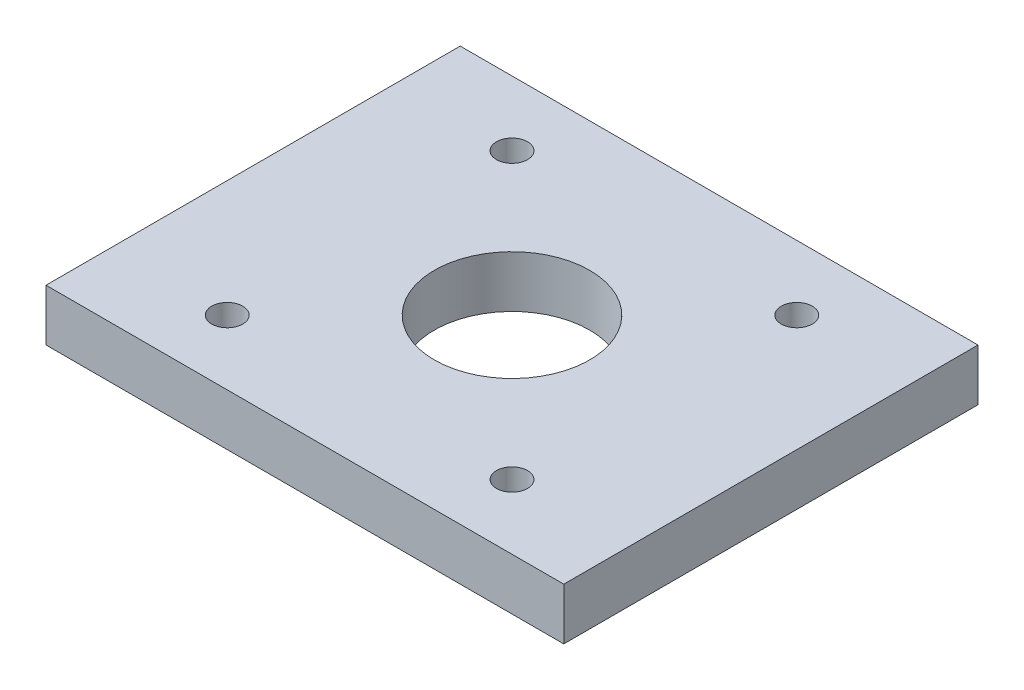
ISO-10303-21;
HEADER;
FILE_DESCRIPTION(('STEP AP214'),'2;1');
FILE_NAME('part.step','',(''),(''),'','','');
FILE_SCHEMA(('AUTOMOTIVE_DESIGN { 1 0 10303 214 1 1 1 1 }'));
ENDSEC;
DATA;
#1=APPLICATION_CONTEXT('core data for automotive mechanical design processes');
#2=APPLICATION_PROTOCOL_DEFINITION('international standard','automotive_design',2000,#1);
#3=PRODUCT_CONTEXT('',#1,'mechanical');
#4=PRODUCT('Part','Part','',(#3));
#5=PRODUCT_RELATED_PRODUCT_CATEGORY('part','',(#4));
#6=PRODUCT_DEFINITION_FORMATION('','',#4);
#7=PRODUCT_DEFINITION_CONTEXT('part definition',#1,'design');
#8=PRODUCT_DEFINITION('design','',#6,#7);
#9=PRODUCT_DEFINITION_SHAPE('','',#8);
#10=(LENGTH_UNIT() NAMED_UNIT(*) SI_UNIT(.MILLI.,.METRE.));
#11=(NAMED_UNIT(*) PLANE_ANGLE_UNIT() SI_UNIT($,.RADIAN.));
#12=(NAMED_UNIT(*) SI_UNIT($,.STERADIAN.) SOLID_ANGLE_UNIT());
#13=UNCERTAINTY_MEASURE_WITH_UNIT(LENGTH_MEASURE(1.E-05),#10,'distance_accuracy_value','');
#14=(GEOMETRIC_REPRESENTATION_CONTEXT(3) GLOBAL_UNCERTAINTY_ASSIGNED_CONTEXT((#13)) GLOBAL_UNIT_ASSIGNED_CONTEXT((#10,
#11,#12)) REPRESENTATION_CONTEXT('',''));
#15=CARTESIAN_POINT('',(0.,0.,0.));
#16=DIRECTION('',(0.,0.,1.));
#17=DIRECTION('',(1.,0.,0.));
#18=AXIS2_PLACEMENT_3D('',#15,#16,#17);
#19=CARTESIAN_POINT('',(0.,0.,0.));
#20=DIRECTION('',(0.,-1.,0.));
#21=DIRECTION('',(0.,0.,-1.));
#22=AXIS2_PLACEMENT_3D('',#19,#20,#21);
#23=PLANE('',#22);
#24=CARTESIAN_POINT('',(-55.,0.,-55.));
#25=DIRECTION('',(0.,-1.,0.));
#26=DIRECTION('',(0.,0.,-1.));
#27=AXIS2_PLACEMENT_3D('',#24,#25,#26);
#28=CIRCLE('',#27,11.);
#29=CARTESIAN_POINT('',(-55.,0.,-66.));
#30=VERTEX_POINT('',#29);
#31=EDGE_CURVE('E47',#30,#30,#28,.F.);
#32=ORIENTED_EDGE('',*,*,#31,.T.);
#33=EDGE_LOOP('',(#32));
#34=FACE_BOUND('',#33,.T.);
#35=CARTESIAN_POINT('',(-55.,0.,55.));
#36=DIRECTION('',(0.,-1.,0.));
#37=DIRECTION('',(0.,0.,-1.));
#38=AXIS2_PLACEMENT_3D('',#35,#36,#37);
#39=CIRCLE('',#38,11.);
#40=CARTESIAN_POINT('',(-55.,0.,44.));
#41=VERTEX_POINT('',#40);
#42=EDGE_CURVE('E117',#41,#41,#39,.F.);
#43=ORIENTED_EDGE('',*,*,#42,.T.);
#44=EDGE_LOOP('',(#43));
#45=FACE_BOUND('',#44,.T.);
#46=CARTESIAN_POINT('',(0.,0.,0.));
#47=DIRECTION('',(0.,-1.,0.));
#48=DIRECTION('',(0.,0.,-1.));
#49=AXIS2_PLACEMENT_3D('',#46,#47,#48);
#50=CIRCLE('',#49,30.);
#51=CARTESIAN_POINT('',(0.,0.,-30.));
#52=VERTEX_POINT('',#51);
#53=EDGE_CURVE('E112',#52,#52,#50,.T.);
#54=ORIENTED_EDGE('',*,*,#53,.F.);
#55=EDGE_LOOP('',(#54));
#56=FACE_BOUND('',#55,.T.);
#57=DIRECTION('',(0.,0.,1.));
#58=VECTOR('',#57,1.);
#59=CARTESIAN_POINT('',(100.,0.,-80.));
#60=LINE('',#59,#58);
#61=CARTESIAN_POINT('',(100.,0.,-80.));
#62=VERTEX_POINT('',#61);
#63=CARTESIAN_POINT('',(100.,0.,80.));
#64=VERTEX_POINT('',#63);
#65=EDGE_CURVE('E108',#62,#64,#60,.T.);
#66=ORIENTED_EDGE('',*,*,#65,.T.);
#67=DIRECTION('',(-1.,0.,0.));
#68=VECTOR('',#67,1.);
#69=CARTESIAN_POINT('',(100.,0.,80.));
#70=LINE('',#69,#68);
#71=CARTESIAN_POINT('',(-100.,0.,80.));
#72=VERTEX_POINT('',#71);
#73=EDGE_CURVE('E111',#64,#72,#70,.T.);
#74=ORIENTED_EDGE('',*,*,#73,.T.);
#75=DIRECTION('',(0.,0.,1.));
#76=VECTOR('',#75,1.);
#77=CARTESIAN_POINT('',(-100.,0.,-80.));
#78=LINE('',#77,#76);
#79=CARTESIAN_POINT('',(-100.,0.,-80.));
#80=VERTEX_POINT('',#79);
#81=EDGE_CURVE('E97',#80,#72,#78,.T.);
#82=ORIENTED_EDGE('',*,*,#81,.F.);
#83=DIRECTION('',(-1.,0.,0.));
#84=VECTOR('',#83,1.);
#85=CARTESIAN_POINT('',(100.,0.,-80.));
#86=LINE('',#85,#84);
#87=EDGE_CURVE('E72',#62,#80,#86,.T.);
#88=ORIENTED_EDGE('',*,*,#87,.F.);
#89=EDGE_LOOP('',(#66,#74,#82,#88));
#90=FACE_BOUND('',#89,.T.);
#91=CARTESIAN_POINT('',(55.,0.,55.));
#92=DIRECTION('',(0.,-1.,0.));
#93=DIRECTION('',(0.,0.,-1.));
#94=AXIS2_PLACEMENT_3D('',#91,#92,#93);
#95=CIRCLE('',#94,11.);
#96=CARTESIAN_POINT('',(55.,0.,44.));
#97=VERTEX_POINT('',#96);
#98=EDGE_CURVE('E126',#97,#97,#95,.F.);
#99=ORIENTED_EDGE('',*,*,#98,.T.);
#100=EDGE_LOOP('',(#99));
#101=FACE_BOUND('',#100,.T.);
#102=CARTESIAN_POINT('',(55.,0.,-55.));
#103=DIRECTION('',(0.,-1.,0.));
#104=DIRECTION('',(0.,0.,-1.));
#105=AXIS2_PLACEMENT_3D('',#102,#103,#104);
#106=CIRCLE('',#105,11.);
#107=CARTESIAN_POINT('',(55.,0.,-66.));
#108=VERTEX_POINT('',#107);
#109=EDGE_CURVE('E11',#108,#108,#106,.F.);
#110=ORIENTED_EDGE('',*,*,#109,.T.);
#111=EDGE_LOOP('',(#110));
#112=FACE_BOUND('',#111,.T.);
#113=ADVANCED_FACE('F37',(#34,#45,#56,#90,#101,#112),#23,.T.);
#114=ORIENTED_EDGE('',*,*,#109,.F.);
#115=EDGE_LOOP('',(#114));
#116=FACE_BOUND('',#115,.T.);
#117=CARTESIAN_POINT('',(55.,0.,-55.));
#118=DIRECTION('',(0.,-1.,0.));
#119=DIRECTION('',(0.,0.,-1.));
#120=AXIS2_PLACEMENT_3D('',#117,#118,#119);
#121=CIRCLE('',#120,5.99999999999999);
#122=CARTESIAN_POINT('',(55.,0.,-61.));
#123=VERTEX_POINT('',#122);
#124=EDGE_CURVE('E154',#123,#123,#121,.T.);
#125=ORIENTED_EDGE('',*,*,#124,.F.);
#126=EDGE_LOOP('',(#125));
#127=FACE_BOUND('',#126,.T.);
#128=ADVANCED_FACE('F141',(#116,#127),#23,.T.);
#129=ORIENTED_EDGE('',*,*,#31,.F.);
#130=EDGE_LOOP('',(#129));
#131=FACE_BOUND('',#130,.T.);
#132=CARTESIAN_POINT('',(-55.,0.,-55.));
#133=DIRECTION('',(0.,-1.,0.));
#134=DIRECTION('',(0.,0.,-1.));
#135=AXIS2_PLACEMENT_3D('',#132,#133,#134);
#136=CIRCLE('',#135,5.99999999999999);
#137=CARTESIAN_POINT('',(-55.,0.,-61.));
#138=VERTEX_POINT('',#137);
#139=EDGE_CURVE('E145',#138,#138,#136,.T.);
#140=ORIENTED_EDGE('',*,*,#139,.F.);
#141=EDGE_LOOP('',(#140));
#142=FACE_BOUND('',#141,.T.);
#143=ADVANCED_FACE('F137',(#131,#142),#23,.T.);
#144=ORIENTED_EDGE('',*,*,#98,.F.);
#145=EDGE_LOOP('',(#144));
#146=FACE_BOUND('',#145,.T.);
#147=CARTESIAN_POINT('',(55.,0.,55.));
#148=DIRECTION('',(0.,-1.,0.));
#149=DIRECTION('',(0.,0.,-1.));
#150=AXIS2_PLACEMENT_3D('',#147,#148,#149);
#151=CIRCLE('',#150,5.99999999999999);
#152=CARTESIAN_POINT('',(55.,0.,49.));
#153=VERTEX_POINT('',#152);
#154=EDGE_CURVE('E163',#153,#153,#151,.T.);
#155=ORIENTED_EDGE('',*,*,#154,.F.);
#156=EDGE_LOOP('',(#155));
#157=FACE_BOUND('',#156,.T.);
#158=ADVANCED_FACE('F140',(#146,#157),#23,.T.);
#159=CARTESIAN_POINT('',(100.,20.,-80.));
#160=DIRECTION('',(1.,0.,0.));
#161=DIRECTION('',(0.,0.,-1.));
#162=AXIS2_PLACEMENT_3D('',#159,#160,#161);
#163=PLANE('',#162);
#164=ORIENTED_EDGE('',*,*,#65,.F.);
#165=DIRECTION('',(0.,-1.,0.));
#166=VECTOR('',#165,1.);
#167=CARTESIAN_POINT('',(100.,20.,-80.));
#168=LINE('',#167,#166);
#169=CARTESIAN_POINT('',(100.,20.,-80.));
#170=VERTEX_POINT('',#169);
#171=EDGE_CURVE('E55',#170,#62,#168,.T.);
#172=ORIENTED_EDGE('',*,*,#171,.F.);
#173=DIRECTION('',(0.,0.,1.));
#174=VECTOR('',#173,1.);
#175=CARTESIAN_POINT('',(100.,20.,-80.));
#176=LINE('',#175,#174);
#177=CARTESIAN_POINT('',(100.,20.,80.));
#178=VERTEX_POINT('',#177);
#179=EDGE_CURVE('E102',#170,#178,#176,.T.);
#180=ORIENTED_EDGE('',*,*,#179,.T.);
#181=DIRECTION('',(0.,-1.,0.));
#182=VECTOR('',#181,1.);
#183=CARTESIAN_POINT('',(100.,20.,80.));
#184=LINE('',#183,#182);
#185=EDGE_CURVE('E80',#178,#64,#184,.T.);
#186=ORIENTED_EDGE('',*,*,#185,.T.);
#187=EDGE_LOOP('',(#164,#172,#180,#186));
#188=FACE_BOUND('',#187,.T.);
#189=ADVANCED_FACE('F39',(#188),#163,.T.);
#190=CARTESIAN_POINT('',(100.,20.,-80.));
#191=DIRECTION('',(0.,0.,1.));
#192=DIRECTION('',(1.,0.,0.));
#193=AXIS2_PLACEMENT_3D('',#190,#191,#192);
#194=PLANE('',#193);
#195=ORIENTED_EDGE('',*,*,#87,.T.);
#196=DIRECTION('',(0.,-1.,0.));
#197=VECTOR('',#196,1.);
#198=CARTESIAN_POINT('',(-100.,20.,-80.));
#199=LINE('',#198,#197);
#200=CARTESIAN_POINT('',(-100.,20.,-80.));
#201=VERTEX_POINT('',#200);
#202=EDGE_CURVE('E99',#201,#80,#199,.T.);
#203=ORIENTED_EDGE('',*,*,#202,.F.);
#204=DIRECTION('',(-1.,0.,0.));
#205=VECTOR('',#204,1.);
#206=CARTESIAN_POINT('',(100.,20.,-80.));
#207=LINE('',#206,#205);
#208=EDGE_CURVE('E90',#170,#201,#207,.T.);
#209=ORIENTED_EDGE('',*,*,#208,.F.);
#210=ORIENTED_EDGE('',*,*,#171,.T.);
#211=EDGE_LOOP('',(#195,#203,#209,#210));
#212=FACE_BOUND('',#211,.T.);
#213=ADVANCED_FACE('F188',(#212),#194,.F.);
#214=CARTESIAN_POINT('',(-100.,20.,-80.));
#215=DIRECTION('',(1.,0.,0.));
#216=DIRECTION('',(0.,0.,-1.));
#217=AXIS2_PLACEMENT_3D('',#214,#215,#216);
#218=PLANE('',#217);
#219=ORIENTED_EDGE('',*,*,#81,.T.);
#220=DIRECTION('',(0.,-1.,0.));
#221=VECTOR('',#220,1.);
#222=CARTESIAN_POINT('',(-100.,20.,80.));
#223=LINE('',#222,#221);
#224=CARTESIAN_POINT('',(-100.,20.,80.));
#225=VERTEX_POINT('',#224);
#226=EDGE_CURVE('E94',#225,#72,#223,.T.);
#227=ORIENTED_EDGE('',*,*,#226,.F.);
#228=DIRECTION('',(0.,0.,1.));
#229=VECTOR('',#228,1.);
#230=CARTESIAN_POINT('',(-100.,20.,-80.));
#231=LINE('',#230,#229);
#232=EDGE_CURVE('E85',#201,#225,#231,.T.);
#233=ORIENTED_EDGE('',*,*,#232,.F.);
#234=ORIENTED_EDGE('',*,*,#202,.T.);
#235=EDGE_LOOP('',(#219,#227,#233,#234));
#236=FACE_BOUND('',#235,.T.);
#237=ADVANCED_FACE('F95',(#236),#218,.F.);
#238=CARTESIAN_POINT('',(100.,20.,80.));
#239=DIRECTION('',(0.,0.,1.));
#240=DIRECTION('',(1.,0.,0.));
#241=AXIS2_PLACEMENT_3D('',#238,#239,#240);
#242=PLANE('',#241);
#243=ORIENTED_EDGE('',*,*,#73,.F.);
#244=ORIENTED_EDGE('',*,*,#185,.F.);
#245=DIRECTION('',(-1.,0.,0.));
#246=VECTOR('',#245,1.);
#247=CARTESIAN_POINT('',(100.,20.,80.));
#248=LINE('',#247,#246);
#249=EDGE_CURVE('E89',#178,#225,#248,.T.);
#250=ORIENTED_EDGE('',*,*,#249,.T.);
#251=ORIENTED_EDGE('',*,*,#226,.T.);
#252=EDGE_LOOP('',(#243,#244,#250,#251));
#253=FACE_BOUND('',#252,.T.);
#254=ADVANCED_FACE('F101',(#253),#242,.T.);
#255=CARTESIAN_POINT('',(0.,20.,0.));
#256=DIRECTION('',(0.,-1.,0.));
#257=DIRECTION('',(0.,0.,-1.));
#258=AXIS2_PLACEMENT_3D('',#255,#256,#257);
#259=PLANE('',#258);
#260=CARTESIAN_POINT('',(55.,20.,-55.));
#261=DIRECTION('',(0.,1.,0.));
#262=DIRECTION('',(0.,0.,1.));
#263=AXIS2_PLACEMENT_3D('',#260,#261,#262);
#264=CIRCLE('',#263,5.99999999999998);
#265=CARTESIAN_POINT('',(55.,20.,-49.));
#266=VERTEX_POINT('',#265);
#267=EDGE_CURVE('E314',#266,#266,#264,.T.);
#268=ORIENTED_EDGE('',*,*,#267,.F.);
#269=EDGE_LOOP('',(#268));
#270=FACE_BOUND('',#269,.T.);
#271=CARTESIAN_POINT('',(-55.,20.,-55.));
#272=DIRECTION('',(0.,1.,0.));
#273=DIRECTION('',(0.,0.,1.));
#274=AXIS2_PLACEMENT_3D('',#271,#272,#273);
#275=CIRCLE('',#274,5.99999999999998);
#276=CARTESIAN_POINT('',(-55.,20.,-49.));
#277=VERTEX_POINT('',#276);
#278=EDGE_CURVE('E148',#277,#277,#275,.T.);
#279=ORIENTED_EDGE('',*,*,#278,.F.);
#280=EDGE_LOOP('',(#279));
#281=FACE_BOUND('',#280,.T.);
#282=CARTESIAN_POINT('',(-55.,20.,55.));
#283=DIRECTION('',(0.,1.,0.));
#284=DIRECTION('',(0.,0.,1.));
#285=AXIS2_PLACEMENT_3D('',#282,#283,#284);
#286=CIRCLE('',#285,5.99999999999998);
#287=CARTESIAN_POINT('',(-55.,20.,61.));
#288=VERTEX_POINT('',#287);
#289=EDGE_CURVE('E147',#288,#288,#286,.T.);
#290=ORIENTED_EDGE('',*,*,#289,.F.);
#291=EDGE_LOOP('',(#290));
#292=FACE_BOUND('',#291,.T.);
#293=CARTESIAN_POINT('',(55.,20.,55.));
#294=DIRECTION('',(0.,1.,0.));
#295=DIRECTION('',(0.,0.,1.));
#296=AXIS2_PLACEMENT_3D('',#293,#294,#295);
#297=CIRCLE('',#296,5.99999999999998);
#298=CARTESIAN_POINT('',(55.,20.,61.));
#299=VERTEX_POINT('',#298);
#300=EDGE_CURVE('E160',#299,#299,#297,.T.);
#301=ORIENTED_EDGE('',*,*,#300,.F.);
#302=EDGE_LOOP('',(#301));
#303=FACE_BOUND('',#302,.T.);
#304=CARTESIAN_POINT('',(0.,20.,0.));
#305=DIRECTION('',(0.,1.,0.));
#306=DIRECTION('',(0.,0.,1.));
#307=AXIS2_PLACEMENT_3D('',#304,#305,#306);
#308=CIRCLE('',#307,30.);
#309=CARTESIAN_POINT('',(0.,20.,30.));
#310=VERTEX_POINT('',#309);
#311=EDGE_CURVE('E122',#310,#310,#308,.T.);
#312=ORIENTED_EDGE('',*,*,#311,.F.);
#313=EDGE_LOOP('',(#312));
#314=FACE_BOUND('',#313,.T.);
#315=ORIENTED_EDGE('',*,*,#179,.F.);
#316=ORIENTED_EDGE('',*,*,#208,.T.);
#317=ORIENTED_EDGE('',*,*,#232,.T.);
#318=ORIENTED_EDGE('',*,*,#249,.F.);
#319=EDGE_LOOP('',(#315,#316,#317,#318));
#320=FACE_BOUND('',#319,.T.);
#321=ADVANCED_FACE('F88',(#270,#281,#292,#303,#314,#320),#259,.F.);
#322=ORIENTED_EDGE('',*,*,#42,.F.);
#323=EDGE_LOOP('',(#322));
#324=FACE_BOUND('',#323,.T.);
#325=CARTESIAN_POINT('',(-55.,0.,55.));
#326=DIRECTION('',(0.,-1.,0.));
#327=DIRECTION('',(0.,0.,-1.));
#328=AXIS2_PLACEMENT_3D('',#325,#326,#327);
#329=CIRCLE('',#328,5.99999999999999);
#330=CARTESIAN_POINT('',(-55.,0.,49.));
#331=VERTEX_POINT('',#330);
#332=EDGE_CURVE('E151',#331,#331,#329,.T.);
#333=ORIENTED_EDGE('',*,*,#332,.F.);
#334=EDGE_LOOP('',(#333));
#335=FACE_BOUND('',#334,.T.);
#336=ADVANCED_FACE('F171',(#324,#335),#23,.T.);
#337=CARTESIAN_POINT('',(0.,-20.,0.));
#338=DIRECTION('',(0.,1.,0.));
#339=DIRECTION('',(0.,0.,1.));
#340=AXIS2_PLACEMENT_3D('',#337,#338,#339);
#341=CYLINDRICAL_SURFACE('',#340,30.);
#342=ORIENTED_EDGE('',*,*,#53,.T.);
#343=EDGE_LOOP('',(#342));
#344=FACE_BOUND('',#343,.T.);
#345=ORIENTED_EDGE('',*,*,#311,.T.);
#346=EDGE_LOOP('',(#345));
#347=FACE_BOUND('',#346,.T.);
#348=ADVANCED_FACE('F168',(#344,#347),#341,.F.);
#349=CARTESIAN_POINT('',(55.,20.,55.));
#350=DIRECTION('',(0.,1.,0.));
#351=DIRECTION('',(0.,0.,1.));
#352=AXIS2_PLACEMENT_3D('',#349,#350,#351);
#353=CYLINDRICAL_SURFACE('',#352,5.99999999999999);
#354=ORIENTED_EDGE('',*,*,#300,.T.);
#355=EDGE_LOOP('',(#354));
#356=FACE_BOUND('',#355,.T.);
#357=ORIENTED_EDGE('',*,*,#154,.T.);
#358=EDGE_LOOP('',(#357));
#359=FACE_BOUND('',#358,.T.);
#360=ADVANCED_FACE('F210',(#356,#359),#353,.F.);
#361=CARTESIAN_POINT('',(-55.,20.,55.));
#362=DIRECTION('',(0.,1.,0.));
#363=DIRECTION('',(0.,0.,1.));
#364=AXIS2_PLACEMENT_3D('',#361,#362,#363);
#365=CYLINDRICAL_SURFACE('',#364,5.99999999999999);
#366=ORIENTED_EDGE('',*,*,#289,.T.);
#367=EDGE_LOOP('',(#366));
#368=FACE_BOUND('',#367,.T.);
#369=ORIENTED_EDGE('',*,*,#332,.T.);
#370=EDGE_LOOP('',(#369));
#371=FACE_BOUND('',#370,.T.);
#372=ADVANCED_FACE('F223',(#368,#371),#365,.F.);
#373=CARTESIAN_POINT('',(-55.,20.,-55.));
#374=DIRECTION('',(0.,1.,0.));
#375=DIRECTION('',(0.,0.,1.));
#376=AXIS2_PLACEMENT_3D('',#373,#374,#375);
#377=CYLINDRICAL_SURFACE('',#376,5.99999999999999);
#378=ORIENTED_EDGE('',*,*,#278,.T.);
#379=EDGE_LOOP('',(#378));
#380=FACE_BOUND('',#379,.T.);
#381=ORIENTED_EDGE('',*,*,#139,.T.);
#382=EDGE_LOOP('',(#381));
#383=FACE_BOUND('',#382,.T.);
#384=ADVANCED_FACE('F233',(#380,#383),#377,.F.);
#385=CARTESIAN_POINT('',(55.,20.,-55.));
#386=DIRECTION('',(0.,1.,0.));
#387=DIRECTION('',(0.,0.,1.));
#388=AXIS2_PLACEMENT_3D('',#385,#386,#387);
#389=CYLINDRICAL_SURFACE('',#388,5.99999999999999);
#390=ORIENTED_EDGE('',*,*,#267,.T.);
#391=EDGE_LOOP('',(#390));
#392=FACE_BOUND('',#391,.T.);
#393=ORIENTED_EDGE('',*,*,#124,.T.);
#394=EDGE_LOOP('',(#393));
#395=FACE_BOUND('',#394,.T.);
#396=ADVANCED_FACE('F243',(#392,#395),#389,.F.);
#397=CLOSED_SHELL('',(#113,#128,#143,#158,#189,#213,#237,#254,#321,#336,#348,#360,#372,#384,#396));
#398=MANIFOLD_SOLID_BREP('B2',#397);
#399=ADVANCED_BREP_SHAPE_REPRESENTATION('',(#18,#398),#14);
#400=SHAPE_DEFINITION_REPRESENTATION(#9,#399);
ENDSEC;
END-ISO-10303-21;
